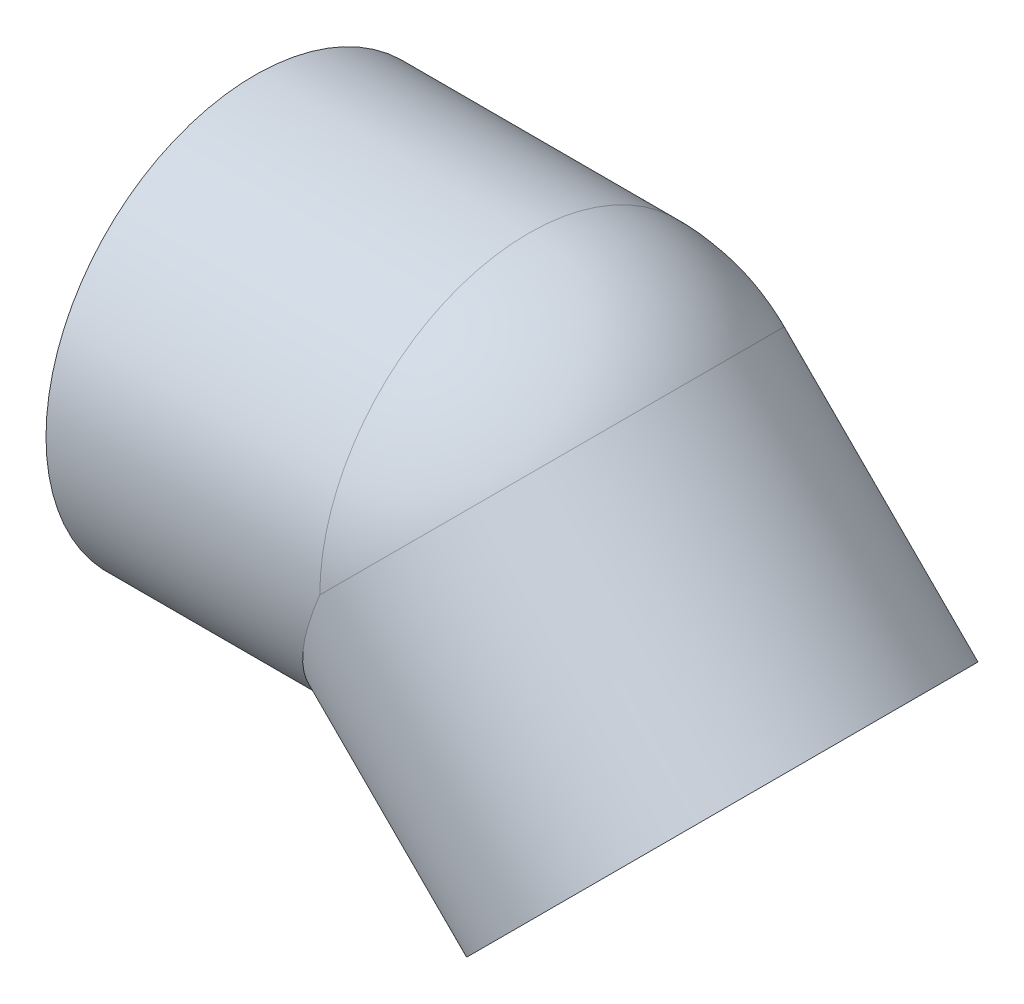
ISO-10303-21;
HEADER;
FILE_DESCRIPTION(('STEP AP214'),'2;1');
FILE_NAME('part.step','',(''),(''),'','','');
FILE_SCHEMA(('AUTOMOTIVE_DESIGN { 1 0 10303 214 1 1 1 1 }'));
ENDSEC;
DATA;
#1=APPLICATION_CONTEXT('core data for automotive mechanical design processes');
#2=APPLICATION_PROTOCOL_DEFINITION('international standard','automotive_design',2000,#1);
#3=PRODUCT_CONTEXT('',#1,'mechanical');
#4=PRODUCT('Part','Part','',(#3));
#5=PRODUCT_RELATED_PRODUCT_CATEGORY('part','',(#4));
#6=PRODUCT_DEFINITION_FORMATION('','',#4);
#7=PRODUCT_DEFINITION_CONTEXT('part definition',#1,'design');
#8=PRODUCT_DEFINITION('design','',#6,#7);
#9=PRODUCT_DEFINITION_SHAPE('','',#8);
#10=(LENGTH_UNIT() NAMED_UNIT(*) SI_UNIT(.MILLI.,.METRE.));
#11=(NAMED_UNIT(*) PLANE_ANGLE_UNIT() SI_UNIT($,.RADIAN.));
#12=(NAMED_UNIT(*) SI_UNIT($,.STERADIAN.) SOLID_ANGLE_UNIT());
#13=UNCERTAINTY_MEASURE_WITH_UNIT(LENGTH_MEASURE(1.E-05),#10,'distance_accuracy_value','');
#14=(GEOMETRIC_REPRESENTATION_CONTEXT(3) GLOBAL_UNCERTAINTY_ASSIGNED_CONTEXT((#13)) GLOBAL_UNIT_ASSIGNED_CONTEXT((#10,
#11,#12)) REPRESENTATION_CONTEXT('',''));
#15=CARTESIAN_POINT('',(0.,0.,0.));
#16=DIRECTION('',(0.,0.,1.));
#17=DIRECTION('',(1.,0.,0.));
#18=AXIS2_PLACEMENT_3D('',#15,#16,#17);
#19=CARTESIAN_POINT('',(100.719300090006,-41.7193000900056,0.));
#20=DIRECTION('',(-0.707106781186558,0.707106781186537,0.));
#21=DIRECTION('',(-0.707106781186537,-0.707106781186558,0.));
#22=AXIS2_PLACEMENT_3D('',#19,#20,#21);
#23=CYLINDRICAL_SURFACE('',#22,40.7);
#24=CARTESIAN_POINT('',(59.,0.,0.));
#25=DIRECTION('',(0.707106781186547,-0.707106781186548,0.));
#26=DIRECTION('',(0.,0.,-1.));
#27=AXIS2_PLACEMENT_3D('',#24,#25,#26);
#28=CIRCLE('',#27,40.7);
#29=CARTESIAN_POINT('',(87.7792459959443,28.7792459926406,0.));
#30=VERTEX_POINT('',#29);
#31=CARTESIAN_POINT('',(58.9999999999995,2.24083753572949E-13,40.7));
#32=VERTEX_POINT('',#31);
#33=EDGE_CURVE('E53',#30,#32,#28,.T.);
#34=ORIENTED_EDGE('',*,*,#33,.F.);
#35=CARTESIAN_POINT('',(59.,0.,0.));
#36=DIRECTION('',(0.70710678106479,-0.707106781308305,0.));
#37=DIRECTION('',(0.,0.,-1.));
#38=AXIS2_PLACEMENT_3D('',#35,#36,#37);
#39=CIRCLE('',#38,40.7);
#40=CARTESIAN_POINT('',(58.9999999999995,2.36774006387693E-13,-40.7));
#41=VERTEX_POINT('',#40);
#42=EDGE_CURVE('E46',#41,#30,#39,.T.);
#43=ORIENTED_EDGE('',*,*,#42,.F.);
#44=CARTESIAN_POINT('',(58.9999999999994,0.,0.));
#45=DIRECTION('',(-0.92387953251129,0.382683432365083,0.));
#46=DIRECTION('',(-0.382683432365083,-0.92387953251129,0.));
#47=AXIS2_PLACEMENT_3D('',#44,#45,#46);
#48=ELLIPSE('',#47,44.0533625519003,40.7);
#49=EDGE_CURVE('E55',#32,#41,#48,.F.);
#50=ORIENTED_EDGE('',*,*,#49,.F.);
#51=EDGE_LOOP('',(#34,#43,#50));
#52=FACE_BOUND('',#51,.T.);
#53=CARTESIAN_POINT('',(100.719300090007,-41.7193000900064,0.));
#54=DIRECTION('',(-0.707106781186558,0.707106781186537,0.));
#55=DIRECTION('',(-0.707106781186537,-0.707106781186558,0.));
#56=AXIS2_PLACEMENT_3D('',#53,#54,#55);
#57=CIRCLE('',#56,40.7);
#58=CARTESIAN_POINT('',(71.940054095715,-70.4985460842993,0.));
#59=VERTEX_POINT('',#58);
#60=EDGE_CURVE('E18',#59,#59,#57,.T.);
#61=ORIENTED_EDGE('',*,*,#60,.F.);
#62=EDGE_LOOP('',(#61));
#63=FACE_BOUND('',#62,.T.);
#64=ADVANCED_FACE('F15',(#52,#63),#23,.F.);
#65=CARTESIAN_POINT('',(59.,0.,0.));
#66=DIRECTION('',(0.,0.,1.));
#67=DIRECTION('',(-1.,0.,0.));
#68=AXIS2_PLACEMENT_3D('',#65,#66,#67);
#69=SPHERICAL_SURFACE('',#68,40.7);
#70=CARTESIAN_POINT('',(59.,0.,0.));
#71=DIRECTION('',(-1.,0.,0.));
#72=DIRECTION('',(0.,1.,0.));
#73=AXIS2_PLACEMENT_3D('',#70,#71,#72);
#74=CIRCLE('',#73,40.7);
#75=EDGE_CURVE('E51',#41,#32,#74,.F.);
#76=ORIENTED_EDGE('',*,*,#75,.F.);
#77=ORIENTED_EDGE('',*,*,#42,.T.);
#78=ORIENTED_EDGE('',*,*,#33,.T.);
#79=EDGE_LOOP('',(#76,#77,#78));
#80=FACE_BOUND('',#79,.T.);
#81=ADVANCED_FACE('F58',(#80),#69,.F.);
#82=CARTESIAN_POINT('',(132.539105243404,-9.89949493660873,45.5400021082703));
#83=DIRECTION('',(0.707106781186548,-0.707106781186547,0.));
#84=DIRECTION('',(-0.707106781186547,-0.707106781186548,0.));
#85=AXIS2_PLACEMENT_3D('',#82,#83,#84);
#86=PLANE('',#85);
#87=ORIENTED_EDGE('',*,*,#60,.T.);
#88=EDGE_LOOP('',(#87));
#89=FACE_BOUND('',#88,.T.);
#90=CARTESIAN_POINT('',(100.719300090007,-41.7193000900065,0.));
#91=DIRECTION('',(-0.707106781186558,0.707106781186537,0.));
#92=DIRECTION('',(-0.707106781186537,-0.707106781186558,0.));
#93=AXIS2_PLACEMENT_3D('',#90,#91,#92);
#94=CIRCLE('',#93,45.);
#95=CARTESIAN_POINT('',(68.8994949366129,-73.5391052434016,0.));
#96=VERTEX_POINT('',#95);
#97=EDGE_CURVE('E71',#96,#96,#94,.T.);
#98=ORIENTED_EDGE('',*,*,#97,.F.);
#99=EDGE_LOOP('',(#98));
#100=FACE_BOUND('',#99,.T.);
#101=ADVANCED_FACE('F80',(#89,#100),#86,.T.);
#102=CARTESIAN_POINT('',(59.,0.,0.));
#103=DIRECTION('',(-1.,0.,0.));
#104=DIRECTION('',(0.,0.,1.));
#105=AXIS2_PLACEMENT_3D('',#102,#103,#104);
#106=CYLINDRICAL_SURFACE('',#105,40.7);
#107=CARTESIAN_POINT('',(0.,0.,0.));
#108=DIRECTION('',(-1.,0.,0.));
#109=DIRECTION('',(0.,0.,1.));
#110=AXIS2_PLACEMENT_3D('',#107,#108,#109);
#111=CIRCLE('',#110,40.7);
#112=CARTESIAN_POINT('',(0.,0.,40.7));
#113=VERTEX_POINT('',#112);
#114=EDGE_CURVE('E68',#113,#113,#111,.F.);
#115=ORIENTED_EDGE('',*,*,#114,.F.);
#116=EDGE_LOOP('',(#115));
#117=FACE_BOUND('',#116,.T.);
#118=ORIENTED_EDGE('',*,*,#49,.T.);
#119=ORIENTED_EDGE('',*,*,#75,.T.);
#120=EDGE_LOOP('',(#118,#119));
#121=FACE_BOUND('',#120,.T.);
#122=ADVANCED_FACE('F83',(#117,#121),#106,.F.);
#123=CARTESIAN_POINT('',(59.,0.,0.));
#124=DIRECTION('',(0.,0.,1.));
#125=DIRECTION('',(1.,0.,0.));
#126=AXIS2_PLACEMENT_3D('',#123,#124,#125);
#127=SPHERICAL_SURFACE('',#126,45.);
#128=CARTESIAN_POINT('',(59.,0.,0.));
#129=DIRECTION('',(-1.,0.,0.));
#130=DIRECTION('',(0.,1.,0.));
#131=AXIS2_PLACEMENT_3D('',#128,#129,#130);
#132=CIRCLE('',#131,45.);
#133=CARTESIAN_POINT('',(58.9999999999995,2.31971782946013E-13,45.));
#134=VERTEX_POINT('',#133);
#135=CARTESIAN_POINT('',(58.9999999999995,2.05289561333825E-13,-45.0000000000001));
#136=VERTEX_POINT('',#135);
#137=EDGE_CURVE('E67',#134,#136,#132,.T.);
#138=ORIENTED_EDGE('',*,*,#137,.F.);
#139=CARTESIAN_POINT('',(59.,0.,0.));
#140=DIRECTION('',(-0.707106781047108,0.707106781325987,0.));
#141=DIRECTION('',(0.,0.,1.));
#142=AXIS2_PLACEMENT_3D('',#139,#140,#141);
#143=CIRCLE('',#142,45.);
#144=CARTESIAN_POINT('',(90.8198051565318,31.8198051502575,0.));
#145=VERTEX_POINT('',#144);
#146=EDGE_CURVE('E73',#134,#145,#143,.T.);
#147=ORIENTED_EDGE('',*,*,#146,.T.);
#148=CARTESIAN_POINT('',(58.9999999999997,-3.12250225675825E-13,0.));
#149=DIRECTION('',(-0.707106781186558,0.707106781186537,0.));
#150=DIRECTION('',(0.707106781186537,0.707106781186558,0.));
#151=AXIS2_PLACEMENT_3D('',#148,#149,#150);
#152=CIRCLE('',#151,45.0000000000004);
#153=EDGE_CURVE('E33',#136,#145,#152,.F.);
#154=ORIENTED_EDGE('',*,*,#153,.F.);
#155=EDGE_LOOP('',(#138,#147,#154));
#156=FACE_BOUND('',#155,.T.);
#157=ADVANCED_FACE('F87',(#156),#127,.T.);
#158=CARTESIAN_POINT('',(58.9999999999997,-3.01841884819964E-13,0.));
#159=DIRECTION('',(-0.707106781186558,0.707106781186537,0.));
#160=DIRECTION('',(-0.707106781186537,-0.707106781186558,0.));
#161=AXIS2_PLACEMENT_3D('',#158,#159,#160);
#162=CYLINDRICAL_SURFACE('',#161,45.);
#163=ORIENTED_EDGE('',*,*,#97,.T.);
#164=EDGE_LOOP('',(#163));
#165=FACE_BOUND('',#164,.T.);
#166=CARTESIAN_POINT('',(58.9999999999994,0.,0.));
#167=DIRECTION('',(-0.92387953251129,0.382683432365083,0.));
#168=DIRECTION('',(0.382683432365083,0.92387953251129,0.));
#169=AXIS2_PLACEMENT_3D('',#166,#167,#168);
#170=ELLIPSE('',#169,48.7076490131576,45.);
#171=EDGE_CURVE('E24',#136,#134,#170,.T.);
#172=ORIENTED_EDGE('',*,*,#171,.F.);
#173=ORIENTED_EDGE('',*,*,#153,.T.);
#174=ORIENTED_EDGE('',*,*,#146,.F.);
#175=EDGE_LOOP('',(#172,#173,#174));
#176=FACE_BOUND('',#175,.T.);
#177=ADVANCED_FACE('F91',(#165,#176),#162,.T.);
#178=CARTESIAN_POINT('',(0.,-45.,45.5400021084174));
#179=DIRECTION('',(-1.,0.,0.));
#180=DIRECTION('',(0.,1.,0.));
#181=AXIS2_PLACEMENT_3D('',#178,#179,#180);
#182=PLANE('',#181);
#183=ORIENTED_EDGE('',*,*,#114,.T.);
#184=EDGE_LOOP('',(#183));
#185=FACE_BOUND('',#184,.T.);
#186=CARTESIAN_POINT('',(0.,0.,0.));
#187=DIRECTION('',(-1.,0.,0.));
#188=DIRECTION('',(0.,0.,1.));
#189=AXIS2_PLACEMENT_3D('',#186,#187,#188);
#190=CIRCLE('',#189,45.);
#191=CARTESIAN_POINT('',(0.,0.,45.));
#192=VERTEX_POINT('',#191);
#193=EDGE_CURVE('E9',#192,#192,#190,.F.);
#194=ORIENTED_EDGE('',*,*,#193,.F.);
#195=EDGE_LOOP('',(#194));
#196=FACE_BOUND('',#195,.T.);
#197=ADVANCED_FACE('F105',(#185,#196),#182,.T.);
#198=CARTESIAN_POINT('',(0.,0.,0.));
#199=DIRECTION('',(-1.,0.,0.));
#200=DIRECTION('',(0.,0.,1.));
#201=AXIS2_PLACEMENT_3D('',#198,#199,#200);
#202=CYLINDRICAL_SURFACE('',#201,45.);
#203=ORIENTED_EDGE('',*,*,#171,.T.);
#204=ORIENTED_EDGE('',*,*,#137,.T.);
#205=EDGE_LOOP('',(#203,#204));
#206=FACE_BOUND('',#205,.T.);
#207=ORIENTED_EDGE('',*,*,#193,.T.);
#208=EDGE_LOOP('',(#207));
#209=FACE_BOUND('',#208,.T.);
#210=ADVANCED_FACE('F102',(#206,#209),#202,.T.);
#211=CLOSED_SHELL('',(#64,#81,#101,#122,#157,#177,#197,#210));
#212=MANIFOLD_SOLID_BREP('B1',#211);
#213=ADVANCED_BREP_SHAPE_REPRESENTATION('',(#18,#212),#14);
#214=SHAPE_DEFINITION_REPRESENTATION(#9,#213);
ENDSEC;
END-ISO-10303-21;
